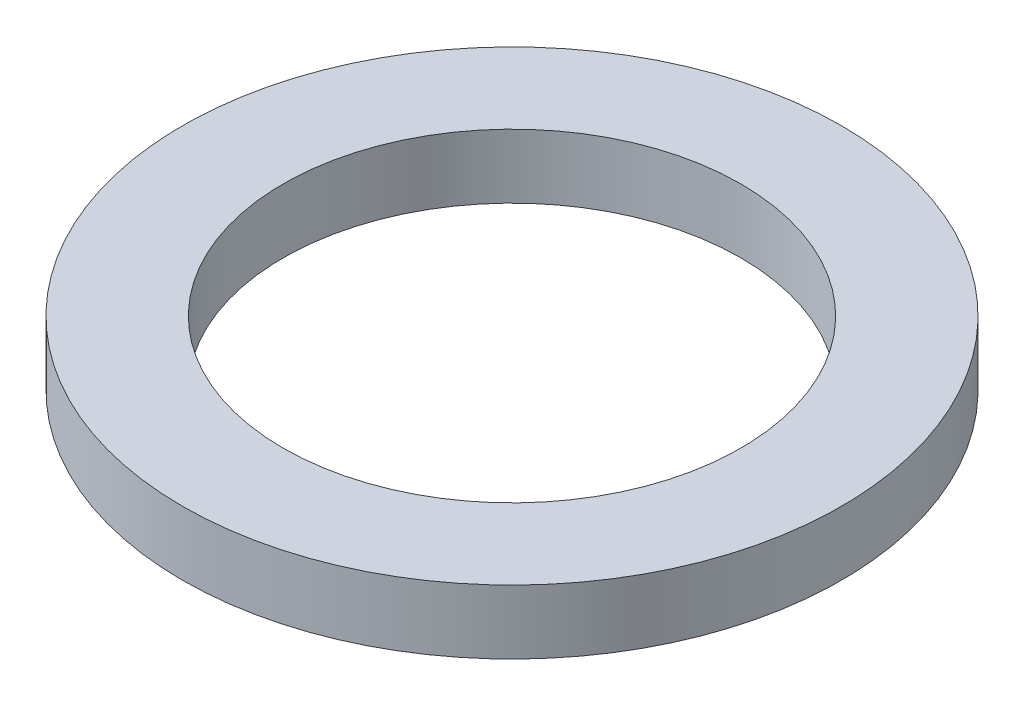
ISO-10303-21;
HEADER;
FILE_DESCRIPTION(('STEP AP214'),'2;1');
FILE_NAME('part.step','',(''),(''),'','','');
FILE_SCHEMA(('AUTOMOTIVE_DESIGN { 1 0 10303 214 1 1 1 1 }'));
ENDSEC;
DATA;
#1=APPLICATION_CONTEXT('core data for automotive mechanical design processes');
#2=APPLICATION_PROTOCOL_DEFINITION('international standard','automotive_design',2000,#1);
#3=PRODUCT_CONTEXT('',#1,'mechanical');
#4=PRODUCT('Part','Part','',(#3));
#5=PRODUCT_RELATED_PRODUCT_CATEGORY('part','',(#4));
#6=PRODUCT_DEFINITION_FORMATION('','',#4);
#7=PRODUCT_DEFINITION_CONTEXT('part definition',#1,'design');
#8=PRODUCT_DEFINITION('design','',#6,#7);
#9=PRODUCT_DEFINITION_SHAPE('','',#8);
#10=(LENGTH_UNIT() NAMED_UNIT(*) SI_UNIT(.MILLI.,.METRE.));
#11=(NAMED_UNIT(*) PLANE_ANGLE_UNIT() SI_UNIT($,.RADIAN.));
#12=(NAMED_UNIT(*) SI_UNIT($,.STERADIAN.) SOLID_ANGLE_UNIT());
#13=UNCERTAINTY_MEASURE_WITH_UNIT(LENGTH_MEASURE(1.E-05),#10,'distance_accuracy_value','');
#14=(GEOMETRIC_REPRESENTATION_CONTEXT(3) GLOBAL_UNCERTAINTY_ASSIGNED_CONTEXT((#13)) GLOBAL_UNIT_ASSIGNED_CONTEXT((#10,
#11,#12)) REPRESENTATION_CONTEXT('',''));
#15=CARTESIAN_POINT('',(0.,0.,0.));
#16=DIRECTION('',(0.,0.,1.));
#17=DIRECTION('',(1.,0.,0.));
#18=AXIS2_PLACEMENT_3D('',#15,#16,#17);
#19=CARTESIAN_POINT('',(0.,60.,0.));
#20=DIRECTION('',(0.,1.,0.));
#21=DIRECTION('',(0.,0.,1.));
#22=AXIS2_PLACEMENT_3D('',#19,#20,#21);
#23=CYLINDRICAL_SURFACE('',#22,12.5);
#24=CARTESIAN_POINT('',(0.,0.,0.));
#25=DIRECTION('',(0.,1.,0.));
#26=DIRECTION('',(0.,0.,1.));
#27=AXIS2_PLACEMENT_3D('',#24,#25,#26);
#28=CIRCLE('',#27,12.5);
#29=CARTESIAN_POINT('',(0.,0.,12.5));
#30=VERTEX_POINT('',#29);
#31=EDGE_CURVE('E44',#30,#30,#28,.T.);
#32=ORIENTED_EDGE('',*,*,#31,.F.);
#33=EDGE_LOOP('',(#32));
#34=FACE_BOUND('',#33,.T.);
#35=CARTESIAN_POINT('',(0.,3.5,0.));
#36=DIRECTION('',(0.,1.,0.));
#37=DIRECTION('',(0.,0.,1.));
#38=AXIS2_PLACEMENT_3D('',#35,#36,#37);
#39=CIRCLE('',#38,12.5);
#40=CARTESIAN_POINT('',(0.,3.5,12.5));
#41=VERTEX_POINT('',#40);
#42=EDGE_CURVE('E10',#41,#41,#39,.T.);
#43=ORIENTED_EDGE('',*,*,#42,.T.);
#44=EDGE_LOOP('',(#43));
#45=FACE_BOUND('',#44,.T.);
#46=ADVANCED_FACE('F30',(#34,#45),#23,.F.);
#47=CARTESIAN_POINT('',(12.5000000000001,3.5,0.));
#48=DIRECTION('',(0.,-1.,0.));
#49=DIRECTION('',(0.,0.,-1.));
#50=AXIS2_PLACEMENT_3D('',#47,#48,#49);
#51=PLANE('',#50);
#52=ORIENTED_EDGE('',*,*,#42,.F.);
#53=EDGE_LOOP('',(#52));
#54=FACE_BOUND('',#53,.T.);
#55=CARTESIAN_POINT('',(0.,3.5,0.));
#56=DIRECTION('',(0.,1.,0.));
#57=DIRECTION('',(0.,0.,1.));
#58=AXIS2_PLACEMENT_3D('',#55,#56,#57);
#59=CIRCLE('',#58,18.);
#60=CARTESIAN_POINT('',(0.,3.5,18.));
#61=VERTEX_POINT('',#60);
#62=EDGE_CURVE('E36',#61,#61,#59,.T.);
#63=ORIENTED_EDGE('',*,*,#62,.T.);
#64=EDGE_LOOP('',(#63));
#65=FACE_BOUND('',#64,.T.);
#66=ADVANCED_FACE('F53',(#54,#65),#51,.F.);
#67=CARTESIAN_POINT('',(0.,60.,0.));
#68=DIRECTION('',(0.,1.,0.));
#69=DIRECTION('',(0.,0.,1.));
#70=AXIS2_PLACEMENT_3D('',#67,#68,#69);
#71=CYLINDRICAL_SURFACE('',#70,18.);
#72=ORIENTED_EDGE('',*,*,#62,.F.);
#73=EDGE_LOOP('',(#72));
#74=FACE_BOUND('',#73,.T.);
#75=CARTESIAN_POINT('',(0.,0.,0.));
#76=DIRECTION('',(0.,1.,0.));
#77=DIRECTION('',(0.,0.,1.));
#78=AXIS2_PLACEMENT_3D('',#75,#76,#77);
#79=CIRCLE('',#78,18.);
#80=CARTESIAN_POINT('',(0.,0.,18.));
#81=VERTEX_POINT('',#80);
#82=EDGE_CURVE('E40',#81,#81,#79,.T.);
#83=ORIENTED_EDGE('',*,*,#82,.T.);
#84=EDGE_LOOP('',(#83));
#85=FACE_BOUND('',#84,.T.);
#86=ADVANCED_FACE('F57',(#74,#85),#71,.T.);
#87=CARTESIAN_POINT('',(12.5,0.,0.));
#88=DIRECTION('',(0.,1.,0.));
#89=DIRECTION('',(0.,0.,1.));
#90=AXIS2_PLACEMENT_3D('',#87,#88,#89);
#91=PLANE('',#90);
#92=ORIENTED_EDGE('',*,*,#82,.F.);
#93=EDGE_LOOP('',(#92));
#94=FACE_BOUND('',#93,.T.);
#95=ORIENTED_EDGE('',*,*,#31,.T.);
#96=EDGE_LOOP('',(#95));
#97=FACE_BOUND('',#96,.T.);
#98=ADVANCED_FACE('F50',(#94,#97),#91,.F.);
#99=CLOSED_SHELL('',(#46,#66,#86,#98));
#100=MANIFOLD_SOLID_BREP('B2',#99);
#101=ADVANCED_BREP_SHAPE_REPRESENTATION('',(#18,#100),#14);
#102=SHAPE_DEFINITION_REPRESENTATION(#9,#101);
ENDSEC;
END-ISO-10303-21;
